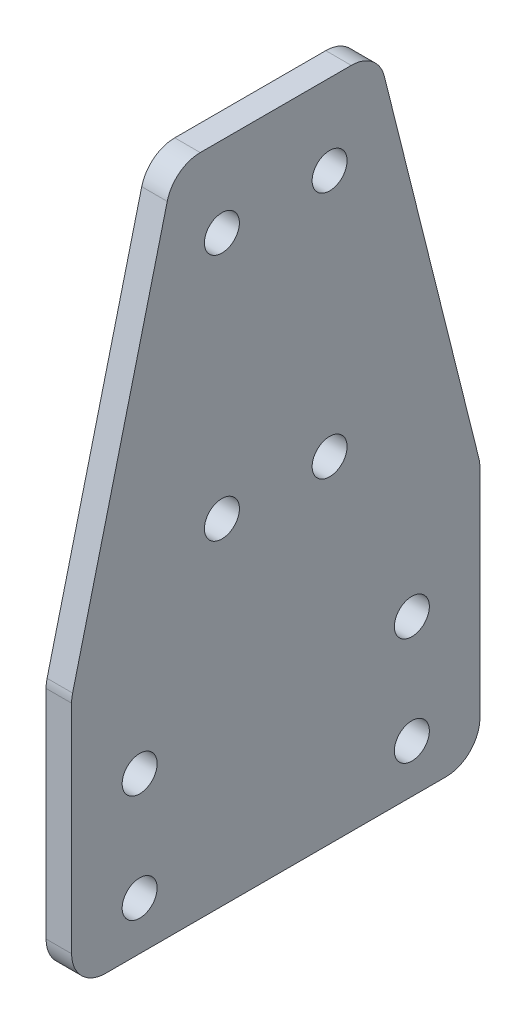
ISO-10303-21;
HEADER;
FILE_DESCRIPTION(('STEP AP214'),'2;1');
FILE_NAME('part.step','',(''),(''),'','','');
FILE_SCHEMA(('AUTOMOTIVE_DESIGN { 1 0 10303 214 1 1 1 1 }'));
ENDSEC;
DATA;
#1=APPLICATION_CONTEXT('core data for automotive mechanical design processes');
#2=APPLICATION_PROTOCOL_DEFINITION('international standard','automotive_design',2000,#1);
#3=PRODUCT_CONTEXT('',#1,'mechanical');
#4=PRODUCT('Part','Part','',(#3));
#5=PRODUCT_RELATED_PRODUCT_CATEGORY('part','',(#4));
#6=PRODUCT_DEFINITION_FORMATION('','',#4);
#7=PRODUCT_DEFINITION_CONTEXT('part definition',#1,'design');
#8=PRODUCT_DEFINITION('design','',#6,#7);
#9=PRODUCT_DEFINITION_SHAPE('','',#8);
#10=(LENGTH_UNIT() NAMED_UNIT(*) SI_UNIT(.MILLI.,.METRE.));
#11=(NAMED_UNIT(*) PLANE_ANGLE_UNIT() SI_UNIT($,.RADIAN.));
#12=(NAMED_UNIT(*) SI_UNIT($,.STERADIAN.) SOLID_ANGLE_UNIT());
#13=UNCERTAINTY_MEASURE_WITH_UNIT(LENGTH_MEASURE(1.E-05),#10,'distance_accuracy_value','');
#14=(GEOMETRIC_REPRESENTATION_CONTEXT(3) GLOBAL_UNCERTAINTY_ASSIGNED_CONTEXT((#13)) GLOBAL_UNIT_ASSIGNED_CONTEXT((#10,
#11,#12)) REPRESENTATION_CONTEXT('',''));
#15=CARTESIAN_POINT('',(0.,0.,0.));
#16=DIRECTION('',(0.,0.,1.));
#17=DIRECTION('',(1.,0.,0.));
#18=AXIS2_PLACEMENT_3D('',#15,#16,#17);
#19=CARTESIAN_POINT('',(-234.95,47.625,-130.7));
#20=DIRECTION('',(0.,0.,1.));
#21=DIRECTION('',(0.,-1.,0.));
#22=AXIS2_PLACEMENT_3D('',#19,#20,#21);
#23=PLANE('',#22);
#24=DIRECTION('',(0.,-1.,0.));
#25=VECTOR('',#24,1.);
#26=CARTESIAN_POINT('',(-234.95,47.625,-130.7));
#27=LINE('',#26,#25);
#28=CARTESIAN_POINT('',(-234.95,46.8432792773278,-130.7));
#29=VERTEX_POINT('',#28);
#30=CARTESIAN_POINT('',(-234.95,6.34999999999999,-130.7));
#31=VERTEX_POINT('',#30);
#32=EDGE_CURVE('E209',#29,#31,#27,.T.);
#33=ORIENTED_EDGE('',*,*,#32,.T.);
#34=DIRECTION('',(1.,0.,0.));
#35=VECTOR('',#34,1.);
#36=CARTESIAN_POINT('',(-234.95,6.34999999999999,-130.7));
#37=LINE('',#36,#35);
#38=CARTESIAN_POINT('',(-230.1875,6.34999999999999,-130.7));
#39=VERTEX_POINT('',#38);
#40=EDGE_CURVE('E144',#31,#39,#37,.T.);
#41=ORIENTED_EDGE('',*,*,#40,.T.);
#42=DIRECTION('',(0.,-1.,0.));
#43=VECTOR('',#42,1.);
#44=CARTESIAN_POINT('',(-230.1875,47.625,-130.7));
#45=LINE('',#44,#43);
#46=CARTESIAN_POINT('',(-230.1875,46.8432792773278,-130.7));
#47=VERTEX_POINT('',#46);
#48=EDGE_CURVE('E128',#47,#39,#45,.T.);
#49=ORIENTED_EDGE('',*,*,#48,.F.);
#50=DIRECTION('',(1.,0.,0.));
#51=VECTOR('',#50,1.);
#52=CARTESIAN_POINT('',(-234.95,46.8432792773278,-130.7));
#53=LINE('',#52,#51);
#54=EDGE_CURVE('E141',#47,#29,#53,.F.);
#55=ORIENTED_EDGE('',*,*,#54,.T.);
#56=EDGE_LOOP('',(#33,#41,#49,#55));
#57=FACE_BOUND('',#56,.T.);
#58=ADVANCED_FACE('F35',(#57),#23,.T.);
#59=CARTESIAN_POINT('',(-234.95,123.825,-149.75));
#60=DIRECTION('',(0.,0.242535625036333,0.970142500145332));
#61=DIRECTION('',(0.,-0.970142500145332,0.242535625036333));
#62=AXIS2_PLACEMENT_3D('',#59,#60,#61);
#63=PLANE('',#62);
#64=DIRECTION('',(0.,-0.970142500145332,0.242535625036333));
#65=VECTOR('',#64,1.);
#66=CARTESIAN_POINT('',(-234.95,123.825,-149.75));
#67=LINE('',#66,#65);
#68=CARTESIAN_POINT('',(-234.95,119.015101218981,-148.547525304745));
#69=VERTEX_POINT('',#68);
#70=CARTESIAN_POINT('',(-234.95,48.3833804963085,-130.889595124077));
#71=VERTEX_POINT('',#70);
#72=EDGE_CURVE('E151',#69,#71,#67,.T.);
#73=ORIENTED_EDGE('',*,*,#72,.T.);
#74=DIRECTION('',(1.,0.,0.));
#75=VECTOR('',#74,1.);
#76=CARTESIAN_POINT('',(-234.95,48.3833804963085,-130.889595124077));
#77=LINE('',#76,#75);
#78=CARTESIAN_POINT('',(-230.1875,48.3833804963085,-130.889595124077));
#79=VERTEX_POINT('',#78);
#80=EDGE_CURVE('E194',#71,#79,#77,.T.);
#81=ORIENTED_EDGE('',*,*,#80,.T.);
#82=DIRECTION('',(0.,-0.970142500145332,0.242535625036333));
#83=VECTOR('',#82,1.);
#84=CARTESIAN_POINT('',(-230.1875,123.825,-149.75));
#85=LINE('',#84,#83);
#86=CARTESIAN_POINT('',(-230.1875,119.015101218981,-148.547525304745));
#87=VERTEX_POINT('',#86);
#88=EDGE_CURVE('E130',#87,#79,#85,.T.);
#89=ORIENTED_EDGE('',*,*,#88,.F.);
#90=DIRECTION('',(1.,0.,0.));
#91=VECTOR('',#90,1.);
#92=CARTESIAN_POINT('',(-234.95,119.015101218981,-148.547525304745));
#93=LINE('',#92,#91);
#94=EDGE_CURVE('E192',#87,#69,#93,.F.);
#95=ORIENTED_EDGE('',*,*,#94,.T.);
#96=EDGE_LOOP('',(#73,#81,#89,#95));
#97=FACE_BOUND('',#96,.T.);
#98=ADVANCED_FACE('F317',(#97),#63,.T.);
#99=CARTESIAN_POINT('',(-234.95,123.825,-187.85));
#100=DIRECTION('',(0.,1.,0.));
#101=DIRECTION('',(0.,0.,1.));
#102=AXIS2_PLACEMENT_3D('',#99,#100,#101);
#103=PLANE('',#102);
#104=DIRECTION('',(0.,0.,1.));
#105=VECTOR('',#104,1.);
#106=CARTESIAN_POINT('',(-230.1875,123.825,-187.85));
#107=LINE('',#106,#105);
#108=CARTESIAN_POINT('',(-230.1875,123.825,-182.892069819332));
#109=VERTEX_POINT('',#108);
#110=CARTESIAN_POINT('',(-230.1875,123.825,-154.707930180668));
#111=VERTEX_POINT('',#110);
#112=EDGE_CURVE('E202',#109,#111,#107,.T.);
#113=ORIENTED_EDGE('',*,*,#112,.F.);
#114=DIRECTION('',(1.,0.,0.));
#115=VECTOR('',#114,1.);
#116=CARTESIAN_POINT('',(-234.95,123.825,-182.892069819332));
#117=LINE('',#116,#115);
#118=CARTESIAN_POINT('',(-234.95,123.825,-182.892069819332));
#119=VERTEX_POINT('',#118);
#120=EDGE_CURVE('E11',#109,#119,#117,.F.);
#121=ORIENTED_EDGE('',*,*,#120,.T.);
#122=DIRECTION('',(0.,0.,1.));
#123=VECTOR('',#122,1.);
#124=CARTESIAN_POINT('',(-234.95,123.825,-187.85));
#125=LINE('',#124,#123);
#126=CARTESIAN_POINT('',(-234.95,123.825,-154.707930180668));
#127=VERTEX_POINT('',#126);
#128=EDGE_CURVE('E156',#119,#127,#125,.T.);
#129=ORIENTED_EDGE('',*,*,#128,.T.);
#130=DIRECTION('',(1.,0.,0.));
#131=VECTOR('',#130,1.);
#132=CARTESIAN_POINT('',(-234.95,123.825,-154.707930180668));
#133=LINE('',#132,#131);
#134=EDGE_CURVE('E43',#127,#111,#133,.T.);
#135=ORIENTED_EDGE('',*,*,#134,.T.);
#136=EDGE_LOOP('',(#113,#121,#129,#135));
#137=FACE_BOUND('',#136,.T.);
#138=ADVANCED_FACE('F201',(#137),#103,.T.);
#139=CARTESIAN_POINT('',(-234.95,47.625,-206.9));
#140=DIRECTION('',(0.,0.242535625036333,-0.970142500145332));
#141=DIRECTION('',(0.,0.970142500145332,0.242535625036333));
#142=AXIS2_PLACEMENT_3D('',#139,#140,#141);
#143=PLANE('',#142);
#144=DIRECTION('',(0.,0.970142500145332,0.242535625036333));
#145=VECTOR('',#144,1.);
#146=CARTESIAN_POINT('',(-230.1875,47.625,-206.9));
#147=LINE('',#146,#145);
#148=CARTESIAN_POINT('',(-230.1875,48.3833804963085,-206.710404875923));
#149=VERTEX_POINT('',#148);
#150=CARTESIAN_POINT('',(-230.1875,119.015101218981,-189.052474695255));
#151=VERTEX_POINT('',#150);
#152=EDGE_CURVE('E208',#149,#151,#147,.T.);
#153=ORIENTED_EDGE('',*,*,#152,.F.);
#154=DIRECTION('',(1.,0.,0.));
#155=VECTOR('',#154,1.);
#156=CARTESIAN_POINT('',(-234.95,48.3833804963085,-206.710404875923));
#157=LINE('',#156,#155);
#158=CARTESIAN_POINT('',(-234.95,48.3833804963085,-206.710404875923));
#159=VERTEX_POINT('',#158);
#160=EDGE_CURVE('E190',#149,#159,#157,.F.);
#161=ORIENTED_EDGE('',*,*,#160,.T.);
#162=DIRECTION('',(0.,0.970142500145332,0.242535625036333));
#163=VECTOR('',#162,1.);
#164=CARTESIAN_POINT('',(-234.95,47.625,-206.9));
#165=LINE('',#164,#163);
#166=CARTESIAN_POINT('',(-234.95,119.015101218981,-189.052474695255));
#167=VERTEX_POINT('',#166);
#168=EDGE_CURVE('E218',#159,#167,#165,.T.);
#169=ORIENTED_EDGE('',*,*,#168,.T.);
#170=DIRECTION('',(1.,0.,0.));
#171=VECTOR('',#170,1.);
#172=CARTESIAN_POINT('',(-234.95,119.015101218981,-189.052474695255));
#173=LINE('',#172,#171);
#174=EDGE_CURVE('E187',#167,#151,#173,.T.);
#175=ORIENTED_EDGE('',*,*,#174,.T.);
#176=EDGE_LOOP('',(#153,#161,#169,#175));
#177=FACE_BOUND('',#176,.T.);
#178=ADVANCED_FACE('F351',(#177),#143,.T.);
#179=CARTESIAN_POINT('',(-234.95,0.,-206.9));
#180=DIRECTION('',(0.,0.,-1.));
#181=DIRECTION('',(-1.,0.,0.));
#182=AXIS2_PLACEMENT_3D('',#179,#180,#181);
#183=PLANE('',#182);
#184=DIRECTION('',(0.,1.,0.));
#185=VECTOR('',#184,1.);
#186=CARTESIAN_POINT('',(-230.1875,0.,-206.9));
#187=LINE('',#186,#185);
#188=CARTESIAN_POINT('',(-230.1875,6.35,-206.9));
#189=VERTEX_POINT('',#188);
#190=CARTESIAN_POINT('',(-230.1875,46.8432792773278,-206.9));
#191=VERTEX_POINT('',#190);
#192=EDGE_CURVE('E210',#189,#191,#187,.T.);
#193=ORIENTED_EDGE('',*,*,#192,.F.);
#194=DIRECTION('',(1.,0.,0.));
#195=VECTOR('',#194,1.);
#196=CARTESIAN_POINT('',(-234.95,6.35,-206.9));
#197=LINE('',#196,#195);
#198=CARTESIAN_POINT('',(-234.95,6.35,-206.9));
#199=VERTEX_POINT('',#198);
#200=EDGE_CURVE('E57',#189,#199,#197,.F.);
#201=ORIENTED_EDGE('',*,*,#200,.T.);
#202=DIRECTION('',(0.,1.,0.));
#203=VECTOR('',#202,1.);
#204=CARTESIAN_POINT('',(-234.95,0.,-206.9));
#205=LINE('',#204,#203);
#206=CARTESIAN_POINT('',(-234.95,46.8432792773278,-206.9));
#207=VERTEX_POINT('',#206);
#208=EDGE_CURVE('E221',#199,#207,#205,.T.);
#209=ORIENTED_EDGE('',*,*,#208,.T.);
#210=DIRECTION('',(1.,0.,0.));
#211=VECTOR('',#210,1.);
#212=CARTESIAN_POINT('',(-234.95,46.8432792773278,-206.9));
#213=LINE('',#212,#211);
#214=EDGE_CURVE('E183',#207,#191,#213,.T.);
#215=ORIENTED_EDGE('',*,*,#214,.T.);
#216=EDGE_LOOP('',(#193,#201,#209,#215));
#217=FACE_BOUND('',#216,.T.);
#218=ADVANCED_FACE('F354',(#217),#183,.T.);
#219=CARTESIAN_POINT('',(-234.95,0.,-130.7));
#220=DIRECTION('',(0.,-1.,0.));
#221=DIRECTION('',(0.,0.,-1.));
#222=AXIS2_PLACEMENT_3D('',#219,#220,#221);
#223=PLANE('',#222);
#224=DIRECTION('',(0.,0.,-1.));
#225=VECTOR('',#224,1.);
#226=CARTESIAN_POINT('',(-230.1875,0.,-130.7));
#227=LINE('',#226,#225);
#228=CARTESIAN_POINT('',(-230.1875,0.,-137.05));
#229=VERTEX_POINT('',#228);
#230=CARTESIAN_POINT('',(-230.1875,0.,-200.55));
#231=VERTEX_POINT('',#230);
#232=EDGE_CURVE('E145',#229,#231,#227,.T.);
#233=ORIENTED_EDGE('',*,*,#232,.F.);
#234=DIRECTION('',(1.,0.,0.));
#235=VECTOR('',#234,1.);
#236=CARTESIAN_POINT('',(-234.95,0.,-137.05));
#237=LINE('',#236,#235);
#238=CARTESIAN_POINT('',(-234.95,0.,-137.05));
#239=VERTEX_POINT('',#238);
#240=EDGE_CURVE('E171',#229,#239,#237,.F.);
#241=ORIENTED_EDGE('',*,*,#240,.T.);
#242=DIRECTION('',(0.,0.,-1.));
#243=VECTOR('',#242,1.);
#244=CARTESIAN_POINT('',(-234.95,0.,-130.7));
#245=LINE('',#244,#243);
#246=CARTESIAN_POINT('',(-234.95,0.,-200.55));
#247=VERTEX_POINT('',#246);
#248=EDGE_CURVE('E223',#239,#247,#245,.T.);
#249=ORIENTED_EDGE('',*,*,#248,.T.);
#250=DIRECTION('',(1.,0.,0.));
#251=VECTOR('',#250,1.);
#252=CARTESIAN_POINT('',(-234.95,0.,-200.55));
#253=LINE('',#252,#251);
#254=EDGE_CURVE('E168',#247,#231,#253,.T.);
#255=ORIENTED_EDGE('',*,*,#254,.T.);
#256=EDGE_LOOP('',(#233,#241,#249,#255));
#257=FACE_BOUND('',#256,.T.);
#258=ADVANCED_FACE('F326',(#257),#223,.T.);
#259=CARTESIAN_POINT('',(-234.95,0.,0.));
#260=DIRECTION('',(1.,0.,0.));
#261=DIRECTION('',(0.,0.,-1.));
#262=AXIS2_PLACEMENT_3D('',#259,#260,#261);
#263=PLANE('',#262);
#264=CARTESIAN_POINT('',(-234.95,9.,-194.2));
#265=DIRECTION('',(1.,0.,0.));
#266=DIRECTION('',(0.,0.,-1.));
#267=AXIS2_PLACEMENT_3D('',#264,#265,#266);
#268=CIRCLE('',#267,3.26390000000001);
#269=CARTESIAN_POINT('',(-234.95,9.,-197.4639));
#270=VERTEX_POINT('',#269);
#271=EDGE_CURVE('E266',#270,#270,#268,.T.);
#272=ORIENTED_EDGE('',*,*,#271,.T.);
#273=EDGE_LOOP('',(#272));
#274=FACE_BOUND('',#273,.T.);
#275=CARTESIAN_POINT('',(-234.95,9.,-143.4));
#276=DIRECTION('',(1.,0.,0.));
#277=DIRECTION('',(0.,0.,-1.));
#278=AXIS2_PLACEMENT_3D('',#275,#276,#277);
#279=CIRCLE('',#278,3.26390000000001);
#280=CARTESIAN_POINT('',(-234.95,9.,-146.6639));
#281=VERTEX_POINT('',#280);
#282=EDGE_CURVE('E260',#281,#281,#279,.T.);
#283=ORIENTED_EDGE('',*,*,#282,.T.);
#284=EDGE_LOOP('',(#283));
#285=FACE_BOUND('',#284,.T.);
#286=CARTESIAN_POINT('',(-234.95,29.1,-143.4));
#287=DIRECTION('',(1.,0.,0.));
#288=DIRECTION('',(0.,0.,-1.));
#289=AXIS2_PLACEMENT_3D('',#286,#287,#288);
#290=CIRCLE('',#289,3.26390000000001);
#291=CARTESIAN_POINT('',(-234.95,29.1,-146.6639));
#292=VERTEX_POINT('',#291);
#293=EDGE_CURVE('E254',#292,#292,#290,.T.);
#294=ORIENTED_EDGE('',*,*,#293,.T.);
#295=EDGE_LOOP('',(#294));
#296=FACE_BOUND('',#295,.T.);
#297=CARTESIAN_POINT('',(-234.95,62.625,-158.75));
#298=DIRECTION('',(1.,0.,0.));
#299=DIRECTION('',(0.,0.,-1.));
#300=AXIS2_PLACEMENT_3D('',#297,#298,#299);
#301=CIRCLE('',#300,3.26389999999998);
#302=CARTESIAN_POINT('',(-234.95,62.625,-162.0139));
#303=VERTEX_POINT('',#302);
#304=EDGE_CURVE('E248',#303,#303,#301,.T.);
#305=ORIENTED_EDGE('',*,*,#304,.T.);
#306=EDGE_LOOP('',(#305));
#307=FACE_BOUND('',#306,.T.);
#308=CARTESIAN_POINT('',(-234.95,62.625,-178.85));
#309=DIRECTION('',(1.,0.,0.));
#310=DIRECTION('',(0.,0.,-1.));
#311=AXIS2_PLACEMENT_3D('',#308,#309,#310);
#312=CIRCLE('',#311,3.26390000000001);
#313=CARTESIAN_POINT('',(-234.95,62.625,-182.1139));
#314=VERTEX_POINT('',#313);
#315=EDGE_CURVE('E242',#314,#314,#312,.T.);
#316=ORIENTED_EDGE('',*,*,#315,.T.);
#317=EDGE_LOOP('',(#316));
#318=FACE_BOUND('',#317,.T.);
#319=CARTESIAN_POINT('',(-234.95,108.825000028,-178.85));
#320=DIRECTION('',(1.,0.,0.));
#321=DIRECTION('',(0.,0.,-1.));
#322=AXIS2_PLACEMENT_3D('',#319,#320,#321);
#323=CIRCLE('',#322,3.26390000000001);
#324=CARTESIAN_POINT('',(-234.95,108.825000028,-182.1139));
#325=VERTEX_POINT('',#324);
#326=EDGE_CURVE('E236',#325,#325,#323,.T.);
#327=ORIENTED_EDGE('',*,*,#326,.T.);
#328=EDGE_LOOP('',(#327));
#329=FACE_BOUND('',#328,.T.);
#330=CARTESIAN_POINT('',(-234.95,108.825000028,-158.75));
#331=DIRECTION('',(1.,0.,0.));
#332=DIRECTION('',(0.,0.,-1.));
#333=AXIS2_PLACEMENT_3D('',#330,#331,#332);
#334=CIRCLE('',#333,3.26389999999998);
#335=CARTESIAN_POINT('',(-234.95,108.825000028,-162.0139));
#336=VERTEX_POINT('',#335);
#337=EDGE_CURVE('E230',#336,#336,#334,.T.);
#338=ORIENTED_EDGE('',*,*,#337,.T.);
#339=EDGE_LOOP('',(#338));
#340=FACE_BOUND('',#339,.T.);
#341=CARTESIAN_POINT('',(-234.95,29.1,-194.2));
#342=DIRECTION('',(1.,0.,0.));
#343=DIRECTION('',(0.,0.,-1.));
#344=AXIS2_PLACEMENT_3D('',#341,#342,#343);
#345=CIRCLE('',#344,3.26390000000001);
#346=CARTESIAN_POINT('',(-234.95,29.1,-197.4639));
#347=VERTEX_POINT('',#346);
#348=EDGE_CURVE('E146',#347,#347,#345,.T.);
#349=ORIENTED_EDGE('',*,*,#348,.T.);
#350=EDGE_LOOP('',(#349));
#351=FACE_BOUND('',#350,.T.);
#352=ORIENTED_EDGE('',*,*,#248,.F.);
#353=CARTESIAN_POINT('',(-234.95,6.35,-137.05));
#354=DIRECTION('',(1.,0.,0.));
#355=DIRECTION('',(0.,0.,-1.));
#356=AXIS2_PLACEMENT_3D('',#353,#354,#355);
#357=CIRCLE('',#356,6.35);
#358=EDGE_CURVE('E181',#239,#31,#357,.F.);
#359=ORIENTED_EDGE('',*,*,#358,.T.);
#360=ORIENTED_EDGE('',*,*,#32,.F.);
#361=CARTESIAN_POINT('',(-234.95,46.8432792773278,-137.05));
#362=DIRECTION('',(1.,0.,0.));
#363=DIRECTION('',(0.,0.,-1.));
#364=AXIS2_PLACEMENT_3D('',#361,#362,#363);
#365=CIRCLE('',#364,6.35);
#366=EDGE_CURVE('E150',#29,#71,#365,.F.);
#367=ORIENTED_EDGE('',*,*,#366,.T.);
#368=ORIENTED_EDGE('',*,*,#72,.F.);
#369=CARTESIAN_POINT('',(-234.95,117.475,-154.707930180668));
#370=DIRECTION('',(1.,0.,0.));
#371=DIRECTION('',(0.,0.,-1.));
#372=AXIS2_PLACEMENT_3D('',#369,#370,#371);
#373=CIRCLE('',#372,6.35);
#374=EDGE_CURVE('E173',#69,#127,#373,.F.);
#375=ORIENTED_EDGE('',*,*,#374,.T.);
#376=ORIENTED_EDGE('',*,*,#128,.F.);
#377=CARTESIAN_POINT('',(-234.95,117.475,-182.892069819332));
#378=DIRECTION('',(1.,0.,0.));
#379=DIRECTION('',(0.,0.,-1.));
#380=AXIS2_PLACEMENT_3D('',#377,#378,#379);
#381=CIRCLE('',#380,6.35);
#382=EDGE_CURVE('E175',#119,#167,#381,.F.);
#383=ORIENTED_EDGE('',*,*,#382,.T.);
#384=ORIENTED_EDGE('',*,*,#168,.F.);
#385=CARTESIAN_POINT('',(-234.95,46.8432792773278,-200.55));
#386=DIRECTION('',(1.,0.,0.));
#387=DIRECTION('',(0.,0.,-1.));
#388=AXIS2_PLACEMENT_3D('',#385,#386,#387);
#389=CIRCLE('',#388,6.35);
#390=EDGE_CURVE('E50',#159,#207,#389,.F.);
#391=ORIENTED_EDGE('',*,*,#390,.T.);
#392=ORIENTED_EDGE('',*,*,#208,.F.);
#393=CARTESIAN_POINT('',(-234.95,6.35,-200.55));
#394=DIRECTION('',(1.,0.,0.));
#395=DIRECTION('',(0.,0.,-1.));
#396=AXIS2_PLACEMENT_3D('',#393,#394,#395);
#397=CIRCLE('',#396,6.35);
#398=EDGE_CURVE('E179',#199,#247,#397,.F.);
#399=ORIENTED_EDGE('',*,*,#398,.T.);
#400=EDGE_LOOP('',(#352,#359,#360,#367,#368,#375,#376,#383,#384,#391,#392,#399));
#401=FACE_BOUND('',#400,.T.);
#402=ADVANCED_FACE('F275',(#274,#285,#296,#307,#318,#329,#340,#351,#401),#263,.F.);
#403=CARTESIAN_POINT('',(-230.1875,0.,0.));
#404=DIRECTION('',(1.,0.,0.));
#405=DIRECTION('',(0.,0.,-1.));
#406=AXIS2_PLACEMENT_3D('',#403,#404,#405);
#407=PLANE('',#406);
#408=CARTESIAN_POINT('',(-230.1875,9.,-194.2));
#409=DIRECTION('',(1.,0.,0.));
#410=DIRECTION('',(0.,0.,-1.));
#411=AXIS2_PLACEMENT_3D('',#408,#409,#410);
#412=CIRCLE('',#411,3.26390000000001);
#413=CARTESIAN_POINT('',(-230.1875,9.,-197.4639));
#414=VERTEX_POINT('',#413);
#415=EDGE_CURVE('E269',#414,#414,#412,.T.);
#416=ORIENTED_EDGE('',*,*,#415,.F.);
#417=EDGE_LOOP('',(#416));
#418=FACE_BOUND('',#417,.T.);
#419=CARTESIAN_POINT('',(-230.1875,9.,-143.4));
#420=DIRECTION('',(1.,0.,0.));
#421=DIRECTION('',(0.,0.,-1.));
#422=AXIS2_PLACEMENT_3D('',#419,#420,#421);
#423=CIRCLE('',#422,3.26390000000001);
#424=CARTESIAN_POINT('',(-230.1875,9.,-146.6639));
#425=VERTEX_POINT('',#424);
#426=EDGE_CURVE('E263',#425,#425,#423,.T.);
#427=ORIENTED_EDGE('',*,*,#426,.F.);
#428=EDGE_LOOP('',(#427));
#429=FACE_BOUND('',#428,.T.);
#430=CARTESIAN_POINT('',(-230.1875,29.1,-143.4));
#431=DIRECTION('',(1.,0.,0.));
#432=DIRECTION('',(0.,0.,-1.));
#433=AXIS2_PLACEMENT_3D('',#430,#431,#432);
#434=CIRCLE('',#433,3.26390000000001);
#435=CARTESIAN_POINT('',(-230.1875,29.1,-146.6639));
#436=VERTEX_POINT('',#435);
#437=EDGE_CURVE('E257',#436,#436,#434,.T.);
#438=ORIENTED_EDGE('',*,*,#437,.F.);
#439=EDGE_LOOP('',(#438));
#440=FACE_BOUND('',#439,.T.);
#441=CARTESIAN_POINT('',(-230.1875,62.625,-158.75));
#442=DIRECTION('',(1.,0.,0.));
#443=DIRECTION('',(0.,0.,-1.));
#444=AXIS2_PLACEMENT_3D('',#441,#442,#443);
#445=CIRCLE('',#444,3.26389999999998);
#446=CARTESIAN_POINT('',(-230.1875,62.625,-162.0139));
#447=VERTEX_POINT('',#446);
#448=EDGE_CURVE('E251',#447,#447,#445,.T.);
#449=ORIENTED_EDGE('',*,*,#448,.F.);
#450=EDGE_LOOP('',(#449));
#451=FACE_BOUND('',#450,.T.);
#452=CARTESIAN_POINT('',(-230.1875,62.625,-178.85));
#453=DIRECTION('',(1.,0.,0.));
#454=DIRECTION('',(0.,0.,-1.));
#455=AXIS2_PLACEMENT_3D('',#452,#453,#454);
#456=CIRCLE('',#455,3.26390000000001);
#457=CARTESIAN_POINT('',(-230.1875,62.625,-182.1139));
#458=VERTEX_POINT('',#457);
#459=EDGE_CURVE('E245',#458,#458,#456,.T.);
#460=ORIENTED_EDGE('',*,*,#459,.F.);
#461=EDGE_LOOP('',(#460));
#462=FACE_BOUND('',#461,.T.);
#463=CARTESIAN_POINT('',(-230.1875,108.825000028,-178.85));
#464=DIRECTION('',(1.,0.,0.));
#465=DIRECTION('',(0.,0.,-1.));
#466=AXIS2_PLACEMENT_3D('',#463,#464,#465);
#467=CIRCLE('',#466,3.26390000000001);
#468=CARTESIAN_POINT('',(-230.1875,108.825000028,-182.1139));
#469=VERTEX_POINT('',#468);
#470=EDGE_CURVE('E239',#469,#469,#467,.T.);
#471=ORIENTED_EDGE('',*,*,#470,.F.);
#472=EDGE_LOOP('',(#471));
#473=FACE_BOUND('',#472,.T.);
#474=CARTESIAN_POINT('',(-230.1875,108.825000028,-158.75));
#475=DIRECTION('',(1.,0.,0.));
#476=DIRECTION('',(0.,0.,-1.));
#477=AXIS2_PLACEMENT_3D('',#474,#475,#476);
#478=CIRCLE('',#477,3.26389999999998);
#479=CARTESIAN_POINT('',(-230.1875,108.825000028,-162.0139));
#480=VERTEX_POINT('',#479);
#481=EDGE_CURVE('E233',#480,#480,#478,.T.);
#482=ORIENTED_EDGE('',*,*,#481,.F.);
#483=EDGE_LOOP('',(#482));
#484=FACE_BOUND('',#483,.T.);
#485=CARTESIAN_POINT('',(-230.1875,29.1,-194.2));
#486=DIRECTION('',(1.,0.,0.));
#487=DIRECTION('',(0.,0.,-1.));
#488=AXIS2_PLACEMENT_3D('',#485,#486,#487);
#489=CIRCLE('',#488,3.26390000000001);
#490=CARTESIAN_POINT('',(-230.1875,29.1,-197.4639));
#491=VERTEX_POINT('',#490);
#492=EDGE_CURVE('E227',#491,#491,#489,.T.);
#493=ORIENTED_EDGE('',*,*,#492,.F.);
#494=EDGE_LOOP('',(#493));
#495=FACE_BOUND('',#494,.T.);
#496=ORIENTED_EDGE('',*,*,#48,.T.);
#497=CARTESIAN_POINT('',(-230.1875,6.35,-137.05));
#498=DIRECTION('',(1.,0.,0.));
#499=DIRECTION('',(0.,0.,-1.));
#500=AXIS2_PLACEMENT_3D('',#497,#498,#499);
#501=CIRCLE('',#500,6.35);
#502=EDGE_CURVE('E166',#39,#229,#501,.T.);
#503=ORIENTED_EDGE('',*,*,#502,.T.);
#504=ORIENTED_EDGE('',*,*,#232,.T.);
#505=CARTESIAN_POINT('',(-230.1875,6.35,-200.55));
#506=DIRECTION('',(1.,0.,0.));
#507=DIRECTION('',(0.,0.,-1.));
#508=AXIS2_PLACEMENT_3D('',#505,#506,#507);
#509=CIRCLE('',#508,6.35);
#510=EDGE_CURVE('E164',#231,#189,#509,.T.);
#511=ORIENTED_EDGE('',*,*,#510,.T.);
#512=ORIENTED_EDGE('',*,*,#192,.T.);
#513=CARTESIAN_POINT('',(-230.1875,46.8432792773278,-200.55));
#514=DIRECTION('',(1.,0.,0.));
#515=DIRECTION('',(0.,0.,-1.));
#516=AXIS2_PLACEMENT_3D('',#513,#514,#515);
#517=CIRCLE('',#516,6.35);
#518=EDGE_CURVE('E135',#191,#149,#517,.T.);
#519=ORIENTED_EDGE('',*,*,#518,.T.);
#520=ORIENTED_EDGE('',*,*,#152,.T.);
#521=CARTESIAN_POINT('',(-230.1875,117.475,-182.892069819332));
#522=DIRECTION('',(1.,0.,0.));
#523=DIRECTION('',(0.,0.,-1.));
#524=AXIS2_PLACEMENT_3D('',#521,#522,#523);
#525=CIRCLE('',#524,6.35);
#526=EDGE_CURVE('E136',#151,#109,#525,.T.);
#527=ORIENTED_EDGE('',*,*,#526,.T.);
#528=ORIENTED_EDGE('',*,*,#112,.T.);
#529=CARTESIAN_POINT('',(-230.1875,117.475,-154.707930180668));
#530=DIRECTION('',(1.,0.,0.));
#531=DIRECTION('',(0.,0.,-1.));
#532=AXIS2_PLACEMENT_3D('',#529,#530,#531);
#533=CIRCLE('',#532,6.35);
#534=EDGE_CURVE('E153',#111,#87,#533,.T.);
#535=ORIENTED_EDGE('',*,*,#534,.T.);
#536=ORIENTED_EDGE('',*,*,#88,.T.);
#537=CARTESIAN_POINT('',(-230.1875,46.8432792773278,-137.05));
#538=DIRECTION('',(1.,0.,0.));
#539=DIRECTION('',(0.,0.,-1.));
#540=AXIS2_PLACEMENT_3D('',#537,#538,#539);
#541=CIRCLE('',#540,6.35);
#542=EDGE_CURVE('E125',#79,#47,#541,.T.);
#543=ORIENTED_EDGE('',*,*,#542,.T.);
#544=EDGE_LOOP('',(#496,#503,#504,#511,#512,#519,#520,#527,#528,#535,#536,#543));
#545=FACE_BOUND('',#544,.T.);
#546=ADVANCED_FACE('F127',(#418,#429,#440,#451,#462,#473,#484,#495,#545),#407,.T.);
#547=CARTESIAN_POINT('',(-234.95,29.1,-194.2));
#548=DIRECTION('',(1.,0.,0.));
#549=DIRECTION('',(0.,0.,-1.));
#550=AXIS2_PLACEMENT_3D('',#547,#548,#549);
#551=CYLINDRICAL_SURFACE('',#550,3.26390000000001);
#552=ORIENTED_EDGE('',*,*,#348,.F.);
#553=EDGE_LOOP('',(#552));
#554=FACE_BOUND('',#553,.T.);
#555=ORIENTED_EDGE('',*,*,#492,.T.);
#556=EDGE_LOOP('',(#555));
#557=FACE_BOUND('',#556,.T.);
#558=ADVANCED_FACE('F288',(#554,#557),#551,.F.);
#559=CARTESIAN_POINT('',(-234.95,108.825000028,-158.75));
#560=DIRECTION('',(1.,0.,0.));
#561=DIRECTION('',(0.,0.,-1.));
#562=AXIS2_PLACEMENT_3D('',#559,#560,#561);
#563=CYLINDRICAL_SURFACE('',#562,3.26389999999998);
#564=ORIENTED_EDGE('',*,*,#337,.F.);
#565=EDGE_LOOP('',(#564));
#566=FACE_BOUND('',#565,.T.);
#567=ORIENTED_EDGE('',*,*,#481,.T.);
#568=EDGE_LOOP('',(#567));
#569=FACE_BOUND('',#568,.T.);
#570=ADVANCED_FACE('F305',(#566,#569),#563,.F.);
#571=CARTESIAN_POINT('',(-234.95,108.825000028,-178.85));
#572=DIRECTION('',(1.,0.,0.));
#573=DIRECTION('',(0.,0.,-1.));
#574=AXIS2_PLACEMENT_3D('',#571,#572,#573);
#575=CYLINDRICAL_SURFACE('',#574,3.26390000000001);
#576=ORIENTED_EDGE('',*,*,#326,.F.);
#577=EDGE_LOOP('',(#576));
#578=FACE_BOUND('',#577,.T.);
#579=ORIENTED_EDGE('',*,*,#470,.T.);
#580=EDGE_LOOP('',(#579));
#581=FACE_BOUND('',#580,.T.);
#582=ADVANCED_FACE('F311',(#578,#581),#575,.F.);
#583=CARTESIAN_POINT('',(-234.95,62.625,-178.85));
#584=DIRECTION('',(1.,0.,0.));
#585=DIRECTION('',(0.,0.,-1.));
#586=AXIS2_PLACEMENT_3D('',#583,#584,#585);
#587=CYLINDRICAL_SURFACE('',#586,3.26390000000001);
#588=ORIENTED_EDGE('',*,*,#315,.F.);
#589=EDGE_LOOP('',(#588));
#590=FACE_BOUND('',#589,.T.);
#591=ORIENTED_EDGE('',*,*,#459,.T.);
#592=EDGE_LOOP('',(#591));
#593=FACE_BOUND('',#592,.T.);
#594=ADVANCED_FACE('F465',(#590,#593),#587,.F.);
#595=CARTESIAN_POINT('',(-234.95,62.625,-158.75));
#596=DIRECTION('',(1.,0.,0.));
#597=DIRECTION('',(0.,0.,-1.));
#598=AXIS2_PLACEMENT_3D('',#595,#596,#597);
#599=CYLINDRICAL_SURFACE('',#598,3.26389999999998);
#600=ORIENTED_EDGE('',*,*,#304,.F.);
#601=EDGE_LOOP('',(#600));
#602=FACE_BOUND('',#601,.T.);
#603=ORIENTED_EDGE('',*,*,#448,.T.);
#604=EDGE_LOOP('',(#603));
#605=FACE_BOUND('',#604,.T.);
#606=ADVANCED_FACE('F457',(#602,#605),#599,.F.);
#607=CARTESIAN_POINT('',(-234.95,29.1,-143.4));
#608=DIRECTION('',(1.,0.,0.));
#609=DIRECTION('',(0.,0.,-1.));
#610=AXIS2_PLACEMENT_3D('',#607,#608,#609);
#611=CYLINDRICAL_SURFACE('',#610,3.26390000000001);
#612=ORIENTED_EDGE('',*,*,#293,.F.);
#613=EDGE_LOOP('',(#612));
#614=FACE_BOUND('',#613,.T.);
#615=ORIENTED_EDGE('',*,*,#437,.T.);
#616=EDGE_LOOP('',(#615));
#617=FACE_BOUND('',#616,.T.);
#618=ADVANCED_FACE('F449',(#614,#617),#611,.F.);
#619=CARTESIAN_POINT('',(-234.95,9.,-143.4));
#620=DIRECTION('',(1.,0.,0.));
#621=DIRECTION('',(0.,0.,-1.));
#622=AXIS2_PLACEMENT_3D('',#619,#620,#621);
#623=CYLINDRICAL_SURFACE('',#622,3.26390000000001);
#624=ORIENTED_EDGE('',*,*,#282,.F.);
#625=EDGE_LOOP('',(#624));
#626=FACE_BOUND('',#625,.T.);
#627=ORIENTED_EDGE('',*,*,#426,.T.);
#628=EDGE_LOOP('',(#627));
#629=FACE_BOUND('',#628,.T.);
#630=ADVANCED_FACE('F282',(#626,#629),#623,.F.);
#631=CARTESIAN_POINT('',(-234.95,9.,-194.2));
#632=DIRECTION('',(1.,0.,0.));
#633=DIRECTION('',(0.,0.,-1.));
#634=AXIS2_PLACEMENT_3D('',#631,#632,#633);
#635=CYLINDRICAL_SURFACE('',#634,3.26390000000001);
#636=ORIENTED_EDGE('',*,*,#271,.F.);
#637=EDGE_LOOP('',(#636));
#638=FACE_BOUND('',#637,.T.);
#639=ORIENTED_EDGE('',*,*,#415,.T.);
#640=EDGE_LOOP('',(#639));
#641=FACE_BOUND('',#640,.T.);
#642=ADVANCED_FACE('F278',(#638,#641),#635,.F.);
#643=CARTESIAN_POINT('',(-234.95,6.35,-137.05));
#644=DIRECTION('',(1.,0.,0.));
#645=DIRECTION('',(0.,0.,-1.));
#646=AXIS2_PLACEMENT_3D('',#643,#644,#645);
#647=CYLINDRICAL_SURFACE('',#646,6.35);
#648=ORIENTED_EDGE('',*,*,#358,.F.);
#649=ORIENTED_EDGE('',*,*,#240,.F.);
#650=ORIENTED_EDGE('',*,*,#502,.F.);
#651=ORIENTED_EDGE('',*,*,#40,.F.);
#652=EDGE_LOOP('',(#648,#649,#650,#651));
#653=FACE_BOUND('',#652,.T.);
#654=ADVANCED_FACE('F281',(#653),#647,.T.);
#655=CARTESIAN_POINT('',(-234.95,6.35,-200.55));
#656=DIRECTION('',(1.,0.,0.));
#657=DIRECTION('',(0.,0.,-1.));
#658=AXIS2_PLACEMENT_3D('',#655,#656,#657);
#659=CYLINDRICAL_SURFACE('',#658,6.35);
#660=ORIENTED_EDGE('',*,*,#398,.F.);
#661=ORIENTED_EDGE('',*,*,#200,.F.);
#662=ORIENTED_EDGE('',*,*,#510,.F.);
#663=ORIENTED_EDGE('',*,*,#254,.F.);
#664=EDGE_LOOP('',(#660,#661,#662,#663));
#665=FACE_BOUND('',#664,.T.);
#666=ADVANCED_FACE('F330',(#665),#659,.T.);
#667=CARTESIAN_POINT('',(-234.95,46.8432792773278,-200.55));
#668=DIRECTION('',(1.,0.,0.));
#669=DIRECTION('',(0.,0.,-1.));
#670=AXIS2_PLACEMENT_3D('',#667,#668,#669);
#671=CYLINDRICAL_SURFACE('',#670,6.35);
#672=ORIENTED_EDGE('',*,*,#390,.F.);
#673=ORIENTED_EDGE('',*,*,#160,.F.);
#674=ORIENTED_EDGE('',*,*,#518,.F.);
#675=ORIENTED_EDGE('',*,*,#214,.F.);
#676=EDGE_LOOP('',(#672,#673,#674,#675));
#677=FACE_BOUND('',#676,.T.);
#678=ADVANCED_FACE('F334',(#677),#671,.T.);
#679=CARTESIAN_POINT('',(-234.95,46.8432792773278,-137.05));
#680=DIRECTION('',(1.,0.,0.));
#681=DIRECTION('',(0.,0.,-1.));
#682=AXIS2_PLACEMENT_3D('',#679,#680,#681);
#683=CYLINDRICAL_SURFACE('',#682,6.35);
#684=ORIENTED_EDGE('',*,*,#366,.F.);
#685=ORIENTED_EDGE('',*,*,#54,.F.);
#686=ORIENTED_EDGE('',*,*,#542,.F.);
#687=ORIENTED_EDGE('',*,*,#80,.F.);
#688=EDGE_LOOP('',(#684,#685,#686,#687));
#689=FACE_BOUND('',#688,.T.);
#690=ADVANCED_FACE('F149',(#689),#683,.T.);
#691=CARTESIAN_POINT('',(-234.95,117.475,-182.892069819332));
#692=DIRECTION('',(1.,0.,0.));
#693=DIRECTION('',(0.,0.,-1.));
#694=AXIS2_PLACEMENT_3D('',#691,#692,#693);
#695=CYLINDRICAL_SURFACE('',#694,6.35);
#696=ORIENTED_EDGE('',*,*,#382,.F.);
#697=ORIENTED_EDGE('',*,*,#120,.F.);
#698=ORIENTED_EDGE('',*,*,#526,.F.);
#699=ORIENTED_EDGE('',*,*,#174,.F.);
#700=EDGE_LOOP('',(#696,#697,#698,#699));
#701=FACE_BOUND('',#700,.T.);
#702=ADVANCED_FACE('F340',(#701),#695,.T.);
#703=CARTESIAN_POINT('',(-234.95,117.475,-154.707930180668));
#704=DIRECTION('',(1.,0.,0.));
#705=DIRECTION('',(0.,0.,-1.));
#706=AXIS2_PLACEMENT_3D('',#703,#704,#705);
#707=CYLINDRICAL_SURFACE('',#706,6.35);
#708=ORIENTED_EDGE('',*,*,#374,.F.);
#709=ORIENTED_EDGE('',*,*,#94,.F.);
#710=ORIENTED_EDGE('',*,*,#534,.F.);
#711=ORIENTED_EDGE('',*,*,#134,.F.);
#712=EDGE_LOOP('',(#708,#709,#710,#711));
#713=FACE_BOUND('',#712,.T.);
#714=ADVANCED_FACE('F37',(#713),#707,.T.);
#715=CLOSED_SHELL('',(#58,#98,#138,#178,#218,#258,#402,#546,#558,#570,#582,#594,#606,#618,#630,
#642,#654,#666,#678,#690,#702,#714));
#716=MANIFOLD_SOLID_BREP('B2',#715);
#717=ADVANCED_BREP_SHAPE_REPRESENTATION('',(#18,#716),#14);
#718=SHAPE_DEFINITION_REPRESENTATION(#9,#717);
ENDSEC;
END-ISO-10303-21;
